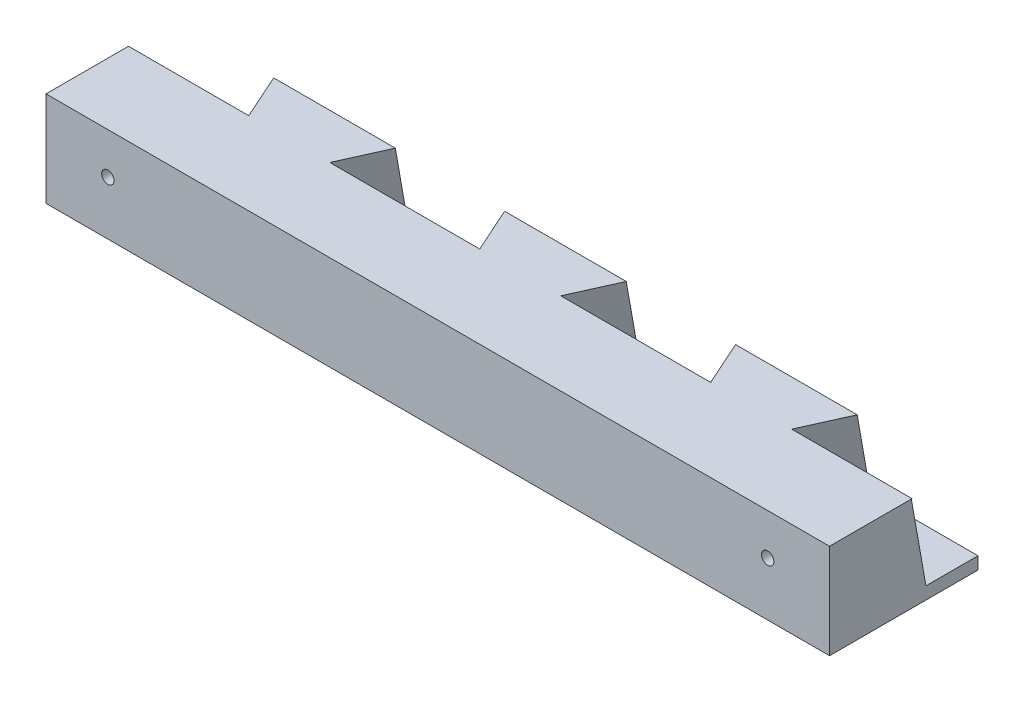
ISO-10303-21;
HEADER;
FILE_DESCRIPTION(('STEP AP214'),'2;1');
FILE_NAME('part.step','',(''),(''),'','','');
FILE_SCHEMA(('AUTOMOTIVE_DESIGN { 1 0 10303 214 1 1 1 1 }'));
ENDSEC;
DATA;
#1=APPLICATION_CONTEXT('core data for automotive mechanical design processes');
#2=APPLICATION_PROTOCOL_DEFINITION('international standard','automotive_design',2000,#1);
#3=PRODUCT_CONTEXT('',#1,'mechanical');
#4=PRODUCT('Part','Part','',(#3));
#5=PRODUCT_RELATED_PRODUCT_CATEGORY('part','',(#4));
#6=PRODUCT_DEFINITION_FORMATION('','',#4);
#7=PRODUCT_DEFINITION_CONTEXT('part definition',#1,'design');
#8=PRODUCT_DEFINITION('design','',#6,#7);
#9=PRODUCT_DEFINITION_SHAPE('','',#8);
#10=(LENGTH_UNIT() NAMED_UNIT(*) SI_UNIT(.MILLI.,.METRE.));
#11=(NAMED_UNIT(*) PLANE_ANGLE_UNIT() SI_UNIT($,.RADIAN.));
#12=(NAMED_UNIT(*) SI_UNIT($,.STERADIAN.) SOLID_ANGLE_UNIT());
#13=UNCERTAINTY_MEASURE_WITH_UNIT(LENGTH_MEASURE(1.E-05),#10,'distance_accuracy_value','');
#14=(GEOMETRIC_REPRESENTATION_CONTEXT(3) GLOBAL_UNCERTAINTY_ASSIGNED_CONTEXT((#13)) GLOBAL_UNIT_ASSIGNED_CONTEXT((#10,
#11,#12)) REPRESENTATION_CONTEXT('',''));
#15=CARTESIAN_POINT('',(0.,0.,0.));
#16=DIRECTION('',(0.,0.,1.));
#17=DIRECTION('',(1.,0.,0.));
#18=AXIS2_PLACEMENT_3D('',#15,#16,#17);
#19=CARTESIAN_POINT('',(0.,10.,0.));
#20=DIRECTION('',(0.,1.,0.));
#21=DIRECTION('',(0.,0.,1.));
#22=AXIS2_PLACEMENT_3D('',#19,#20,#21);
#23=PLANE('',#22);
#24=DIRECTION('',(1.,0.,0.));
#25=VECTOR('',#24,1.);
#26=CARTESIAN_POINT('',(0.,10.,0.));
#27=LINE('',#26,#25);
#28=CARTESIAN_POINT('',(32.9120559660088,10.,0.));
#29=VERTEX_POINT('',#28);
#30=CARTESIAN_POINT('',(47.5,10.,0.));
#31=VERTEX_POINT('',#30);
#32=EDGE_CURVE('E342',#29,#31,#27,.T.);
#33=ORIENTED_EDGE('',*,*,#32,.F.);
#34=DIRECTION('',(-0.410091119671907,0.,0.912044556787793));
#35=VECTOR('',#34,1.);
#36=CARTESIAN_POINT('',(27.3770799575527,10.,12.3098123765815));
#37=LINE('',#36,#35);
#38=CARTESIAN_POINT('',(35.3755299052489,10.,-5.47877749430423));
#39=VERTEX_POINT('',#38);
#40=EDGE_CURVE('E367',#39,#29,#37,.T.);
#41=ORIENTED_EDGE('',*,*,#40,.F.);
#42=DIRECTION('',(1.,0.,0.));
#43=VECTOR('',#42,1.);
#44=CARTESIAN_POINT('',(0.,10.,-5.47877749430424));
#45=LINE('',#44,#43);
#46=CARTESIAN_POINT('',(20.6244700947511,10.,-5.47877749430423));
#47=VERTEX_POINT('',#46);
#48=EDGE_CURVE('E365',#47,#39,#45,.T.);
#49=ORIENTED_EDGE('',*,*,#48,.F.);
#50=DIRECTION('',(-0.410091119671905,0.,-0.912044556787794));
#51=VECTOR('',#50,1.);
#52=CARTESIAN_POINT('',(19.2051353621568,10.,-8.63538453850985));
#53=LINE('',#52,#51);
#54=CARTESIAN_POINT('',(23.0879440339912,10.,0.));
#55=VERTEX_POINT('',#54);
#56=EDGE_CURVE('E363',#55,#47,#53,.T.);
#57=ORIENTED_EDGE('',*,*,#56,.F.);
#58=DIRECTION('',(1.,0.,0.));
#59=VECTOR('',#58,1.);
#60=CARTESIAN_POINT('',(0.,10.,0.));
#61=LINE('',#60,#59);
#62=CARTESIAN_POINT('',(4.91205596600882,10.,0.));
#63=VERTEX_POINT('',#62);
#64=EDGE_CURVE('E345',#63,#55,#61,.T.);
#65=ORIENTED_EDGE('',*,*,#64,.F.);
#66=DIRECTION('',(-0.410091119671905,0.,0.912044556787794));
#67=VECTOR('',#66,1.);
#68=CARTESIAN_POINT('',(4.08597229769799,10.,1.83721391903578));
#69=LINE('',#68,#67);
#70=CARTESIAN_POINT('',(7.37552990524885,10.,-5.47877749430422));
#71=VERTEX_POINT('',#70);
#72=EDGE_CURVE('E360',#71,#63,#69,.T.);
#73=ORIENTED_EDGE('',*,*,#72,.F.);
#74=DIRECTION('',(1.,0.,0.));
#75=VECTOR('',#74,1.);
#76=CARTESIAN_POINT('',(0.,10.,-5.47877749430422));
#77=LINE('',#76,#75);
#78=CARTESIAN_POINT('',(-7.37552990524885,10.,-5.47877749430422));
#79=VERTEX_POINT('',#78);
#80=EDGE_CURVE('E358',#79,#71,#77,.T.);
#81=ORIENTED_EDGE('',*,*,#80,.F.);
#82=DIRECTION('',(-0.410091119671904,0.,-0.912044556787794));
#83=VECTOR('',#82,1.);
#84=CARTESIAN_POINT('',(-4.085972297698,10.,1.83721391903578));
#85=LINE('',#84,#83);
#86=CARTESIAN_POINT('',(-4.91205596600882,10.,0.));
#87=VERTEX_POINT('',#86);
#88=EDGE_CURVE('E356',#87,#79,#85,.T.);
#89=ORIENTED_EDGE('',*,*,#88,.F.);
#90=DIRECTION('',(1.,0.,0.));
#91=VECTOR('',#90,1.);
#92=CARTESIAN_POINT('',(0.,10.,0.));
#93=LINE('',#92,#91);
#94=CARTESIAN_POINT('',(-23.0879440339912,10.,0.));
#95=VERTEX_POINT('',#94);
#96=EDGE_CURVE('E347',#95,#87,#93,.T.);
#97=ORIENTED_EDGE('',*,*,#96,.F.);
#98=DIRECTION('',(-0.410091119671905,0.,0.912044556787794));
#99=VECTOR('',#98,1.);
#100=CARTESIAN_POINT('',(-19.2051353621568,10.,-8.63538453850985));
#101=LINE('',#100,#99);
#102=CARTESIAN_POINT('',(-20.6244700947511,10.,-5.47877749430423));
#103=VERTEX_POINT('',#102);
#104=EDGE_CURVE('E353',#103,#95,#101,.T.);
#105=ORIENTED_EDGE('',*,*,#104,.F.);
#106=DIRECTION('',(1.,0.,0.));
#107=VECTOR('',#106,1.);
#108=CARTESIAN_POINT('',(0.,10.,-5.47877749430422));
#109=LINE('',#108,#107);
#110=CARTESIAN_POINT('',(-35.3755299052488,10.,-5.47877749430423));
#111=VERTEX_POINT('',#110);
#112=EDGE_CURVE('E351',#111,#103,#109,.T.);
#113=ORIENTED_EDGE('',*,*,#112,.F.);
#114=DIRECTION('',(-0.410091119671904,0.,-0.912044556787794));
#115=VECTOR('',#114,1.);
#116=CARTESIAN_POINT('',(-27.3770799575528,10.,12.3098123765814));
#117=LINE('',#116,#115);
#118=CARTESIAN_POINT('',(-32.9120559660088,10.,0.));
#119=VERTEX_POINT('',#118);
#120=EDGE_CURVE('E344',#119,#111,#117,.T.);
#121=ORIENTED_EDGE('',*,*,#120,.F.);
#122=DIRECTION('',(1.,0.,0.));
#123=VECTOR('',#122,1.);
#124=CARTESIAN_POINT('',(0.,10.,0.));
#125=LINE('',#124,#123);
#126=CARTESIAN_POINT('',(-47.5,10.,0.));
#127=VERTEX_POINT('',#126);
#128=EDGE_CURVE('E341',#127,#119,#125,.T.);
#129=ORIENTED_EDGE('',*,*,#128,.F.);
#130=DIRECTION('',(0.,0.,1.));
#131=VECTOR('',#130,1.);
#132=CARTESIAN_POINT('',(-47.5,10.,-10.));
#133=LINE('',#132,#131);
#134=CARTESIAN_POINT('',(-47.5,10.,10.));
#135=VERTEX_POINT('',#134);
#136=EDGE_CURVE('E334',#127,#135,#133,.T.);
#137=ORIENTED_EDGE('',*,*,#136,.T.);
#138=DIRECTION('',(1.,0.,0.));
#139=VECTOR('',#138,1.);
#140=CARTESIAN_POINT('',(-47.5,10.,10.));
#141=LINE('',#140,#139);
#142=CARTESIAN_POINT('',(47.5,10.,10.));
#143=VERTEX_POINT('',#142);
#144=EDGE_CURVE('E66',#135,#143,#141,.T.);
#145=ORIENTED_EDGE('',*,*,#144,.T.);
#146=DIRECTION('',(0.,0.,-1.));
#147=VECTOR('',#146,1.);
#148=CARTESIAN_POINT('',(47.5,10.,-10.));
#149=LINE('',#148,#147);
#150=EDGE_CURVE('E332',#143,#31,#149,.T.);
#151=ORIENTED_EDGE('',*,*,#150,.T.);
#152=EDGE_LOOP('',(#33,#41,#49,#57,#65,#73,#81,#89,#97,#105,#113,#121,#129,#137,#145,#151));
#153=FACE_BOUND('',#152,.T.);
#154=ADVANCED_FACE('F43',(#153),#23,.T.);
#155=CARTESIAN_POINT('',(-47.5,10.,10.));
#156=DIRECTION('',(0.,0.,-1.));
#157=DIRECTION('',(-1.,0.,0.));
#158=AXIS2_PLACEMENT_3D('',#155,#156,#157);
#159=PLANE('',#158);
#160=CARTESIAN_POINT('',(-40.,5.,10.));
#161=DIRECTION('',(0.,0.,1.));
#162=DIRECTION('',(1.,0.,0.));
#163=AXIS2_PLACEMENT_3D('',#160,#161,#162);
#164=CIRCLE('',#163,0.749999999999999);
#165=CARTESIAN_POINT('',(-39.25,5.,10.));
#166=VERTEX_POINT('',#165);
#167=EDGE_CURVE('E232',#166,#166,#164,.T.);
#168=ORIENTED_EDGE('',*,*,#167,.F.);
#169=EDGE_LOOP('',(#168));
#170=FACE_BOUND('',#169,.T.);
#171=CARTESIAN_POINT('',(40.,5.,10.));
#172=DIRECTION('',(0.,0.,1.));
#173=DIRECTION('',(-1.,0.,0.));
#174=AXIS2_PLACEMENT_3D('',#171,#172,#173);
#175=CIRCLE('',#174,0.749999999999999);
#176=CARTESIAN_POINT('',(39.25,5.,10.));
#177=VERTEX_POINT('',#176);
#178=EDGE_CURVE('E224',#177,#177,#175,.T.);
#179=ORIENTED_EDGE('',*,*,#178,.F.);
#180=EDGE_LOOP('',(#179));
#181=FACE_BOUND('',#180,.T.);
#182=DIRECTION('',(0.,-1.,0.));
#183=VECTOR('',#182,1.);
#184=CARTESIAN_POINT('',(-47.5,10.,10.));
#185=LINE('',#184,#183);
#186=CARTESIAN_POINT('',(-47.5,-1.5,10.));
#187=VERTEX_POINT('',#186);
#188=EDGE_CURVE('E339',#135,#187,#185,.T.);
#189=ORIENTED_EDGE('',*,*,#188,.T.);
#190=DIRECTION('',(-1.,0.,0.));
#191=VECTOR('',#190,1.);
#192=CARTESIAN_POINT('',(-47.5,-1.5,10.));
#193=LINE('',#192,#191);
#194=CARTESIAN_POINT('',(47.5,-1.5,10.));
#195=VERTEX_POINT('',#194);
#196=EDGE_CURVE('E211',#195,#187,#193,.T.);
#197=ORIENTED_EDGE('',*,*,#196,.F.);
#198=DIRECTION('',(0.,-1.,0.));
#199=VECTOR('',#198,1.);
#200=CARTESIAN_POINT('',(47.5,10.,10.));
#201=LINE('',#200,#199);
#202=EDGE_CURVE('E337',#143,#195,#201,.T.);
#203=ORIENTED_EDGE('',*,*,#202,.F.);
#204=ORIENTED_EDGE('',*,*,#144,.F.);
#205=EDGE_LOOP('',(#189,#197,#203,#204));
#206=FACE_BOUND('',#205,.T.);
#207=ADVANCED_FACE('F452',(#170,#181,#206),#159,.F.);
#208=CARTESIAN_POINT('',(47.5,10.,-10.));
#209=DIRECTION('',(-1.,0.,0.));
#210=DIRECTION('',(0.,0.,1.));
#211=AXIS2_PLACEMENT_3D('',#208,#209,#210);
#212=PLANE('',#211);
#213=ORIENTED_EDGE('',*,*,#202,.T.);
#214=DIRECTION('',(0.,0.,1.));
#215=VECTOR('',#214,1.);
#216=CARTESIAN_POINT('',(47.5,-1.5,10.));
#217=LINE('',#216,#215);
#218=CARTESIAN_POINT('',(47.5,-1.5,-8.));
#219=VERTEX_POINT('',#218);
#220=EDGE_CURVE('E204',#219,#195,#217,.T.);
#221=ORIENTED_EDGE('',*,*,#220,.F.);
#222=DIRECTION('',(0.,1.,0.));
#223=VECTOR('',#222,1.);
#224=CARTESIAN_POINT('',(47.5,-1.5,-8.));
#225=LINE('',#224,#223);
#226=CARTESIAN_POINT('',(47.5,0.,-8.));
#227=VERTEX_POINT('',#226);
#228=EDGE_CURVE('E200',#219,#227,#225,.T.);
#229=ORIENTED_EDGE('',*,*,#228,.T.);
#230=DIRECTION('',(0.,0.,1.));
#231=VECTOR('',#230,1.);
#232=CARTESIAN_POINT('',(47.5,0.,10.));
#233=LINE('',#232,#231);
#234=CARTESIAN_POINT('',(47.5,0.,-1.68203567813378));
#235=VERTEX_POINT('',#234);
#236=EDGE_CURVE('E214',#227,#235,#233,.T.);
#237=ORIENTED_EDGE('',*,*,#236,.T.);
#238=DIRECTION('',(0.,0.984807753012208,0.17364817766693));
#239=VECTOR('',#238,1.);
#240=CARTESIAN_POINT('',(47.5,-0.964709840352407,-1.85214005154287));
#241=LINE('',#240,#239);
#242=CARTESIAN_POINT('',(47.5,9.98610814578665,0.0787846202409846));
#243=VERTEX_POINT('',#242);
#244=EDGE_CURVE('E271',#235,#243,#241,.T.);
#245=ORIENTED_EDGE('',*,*,#244,.T.);
#246=DIRECTION('',(0.,0.17364817766693,-0.984807753012208));
#247=VECTOR('',#246,1.);
#248=CARTESIAN_POINT('',(47.5,11.865531846847,-10.5799568469409));
#249=LINE('',#248,#247);
#250=EDGE_CURVE('E267',#243,#31,#249,.T.);
#251=ORIENTED_EDGE('',*,*,#250,.T.);
#252=ORIENTED_EDGE('',*,*,#150,.F.);
#253=EDGE_LOOP('',(#213,#221,#229,#237,#245,#251,#252));
#254=FACE_BOUND('',#253,.T.);
#255=ADVANCED_FACE('F45',(#254),#212,.F.);
#256=CARTESIAN_POINT('',(-47.5,10.,-10.));
#257=DIRECTION('',(1.,0.,0.));
#258=DIRECTION('',(0.,0.,-1.));
#259=AXIS2_PLACEMENT_3D('',#256,#257,#258);
#260=PLANE('',#259);
#261=DIRECTION('',(0.,-0.17364817766693,0.984807753012208));
#262=VECTOR('',#261,1.);
#263=CARTESIAN_POINT('',(-47.5,9.98610814578664,0.0787846202409744));
#264=LINE('',#263,#262);
#265=CARTESIAN_POINT('',(-47.5,9.98610814578664,0.0787846202409744));
#266=VERTEX_POINT('',#265);
#267=EDGE_CURVE('E58',#127,#266,#264,.T.);
#268=ORIENTED_EDGE('',*,*,#267,.T.);
#269=DIRECTION('',(0.,0.984807753012208,0.17364817766693));
#270=VECTOR('',#269,1.);
#271=CARTESIAN_POINT('',(-47.5,-0.964709840352415,-1.85214005154288));
#272=LINE('',#271,#270);
#273=CARTESIAN_POINT('',(-47.5,0.,-1.68203567813379));
#274=VERTEX_POINT('',#273);
#275=EDGE_CURVE('E270',#274,#266,#272,.T.);
#276=ORIENTED_EDGE('',*,*,#275,.F.);
#277=DIRECTION('',(0.,0.,-1.));
#278=VECTOR('',#277,1.);
#279=CARTESIAN_POINT('',(-47.5,0.,10.));
#280=LINE('',#279,#278);
#281=CARTESIAN_POINT('',(-47.5,0.,-8.));
#282=VERTEX_POINT('',#281);
#283=EDGE_CURVE('E219',#274,#282,#280,.T.);
#284=ORIENTED_EDGE('',*,*,#283,.T.);
#285=DIRECTION('',(0.,1.,0.));
#286=VECTOR('',#285,1.);
#287=CARTESIAN_POINT('',(-47.5,-1.5,-8.));
#288=LINE('',#287,#286);
#289=CARTESIAN_POINT('',(-47.5,-1.5,-8.));
#290=VERTEX_POINT('',#289);
#291=EDGE_CURVE('E198',#290,#282,#288,.T.);
#292=ORIENTED_EDGE('',*,*,#291,.F.);
#293=DIRECTION('',(0.,0.,-1.));
#294=VECTOR('',#293,1.);
#295=CARTESIAN_POINT('',(-47.5,-1.5,10.));
#296=LINE('',#295,#294);
#297=EDGE_CURVE('E205',#187,#290,#296,.T.);
#298=ORIENTED_EDGE('',*,*,#297,.F.);
#299=ORIENTED_EDGE('',*,*,#188,.F.);
#300=ORIENTED_EDGE('',*,*,#136,.F.);
#301=EDGE_LOOP('',(#268,#276,#284,#292,#298,#299,#300));
#302=FACE_BOUND('',#301,.T.);
#303=ADVANCED_FACE('F216',(#302),#260,.F.);
#304=CARTESIAN_POINT('',(47.5,-0.964709840352407,-1.85214005154287));
#305=DIRECTION('',(0.,-0.17364817766693,0.984807753012208));
#306=DIRECTION('',(0.,-0.984807753012208,-0.17364817766693));
#307=AXIS2_PLACEMENT_3D('',#304,#305,#306);
#308=PLANE('',#307);
#309=DIRECTION('',(0.,0.984807753012208,0.17364817766693));
#310=VECTOR('',#309,1.);
#311=CARTESIAN_POINT('',(32.8755299052488,-0.964709840352407,-1.85214005154288));
#312=LINE('',#311,#310);
#313=CARTESIAN_POINT('',(32.8755299052488,0.,-1.68203567813379));
#314=VERTEX_POINT('',#313);
#315=CARTESIAN_POINT('',(32.8755299052488,9.98610814578665,0.078784620240977));
#316=VERTEX_POINT('',#315);
#317=EDGE_CURVE('E275',#314,#316,#312,.T.);
#318=ORIENTED_EDGE('',*,*,#317,.T.);
#319=DIRECTION('',(1.,0.,0.));
#320=VECTOR('',#319,1.);
#321=CARTESIAN_POINT('',(47.5,9.98610814578665,0.0787846202409846));
#322=LINE('',#321,#320);
#323=EDGE_CURVE('E265',#316,#243,#322,.T.);
#324=ORIENTED_EDGE('',*,*,#323,.T.);
#325=ORIENTED_EDGE('',*,*,#244,.F.);
#326=DIRECTION('',(1.,0.,0.));
#327=VECTOR('',#326,1.);
#328=CARTESIAN_POINT('',(0.,0.,-1.68203567813381));
#329=LINE('',#328,#327);
#330=EDGE_CURVE('E11',#314,#235,#329,.T.);
#331=ORIENTED_EDGE('',*,*,#330,.F.);
#332=EDGE_LOOP('',(#318,#324,#325,#331));
#333=FACE_BOUND('',#332,.T.);
#334=ADVANCED_FACE('F460',(#333),#308,.F.);
#335=CARTESIAN_POINT('',(23.1244700947512,-0.964709840352412,-1.85214005154286));
#336=DIRECTION('',(0.,-0.17364817766693,0.984807753012208));
#337=DIRECTION('',(0.,-0.984807753012208,-0.17364817766693));
#338=AXIS2_PLACEMENT_3D('',#335,#336,#337);
#339=PLANE('',#338);
#340=DIRECTION('',(0.,0.984807753012208,0.17364817766693));
#341=VECTOR('',#340,1.);
#342=CARTESIAN_POINT('',(4.87552990524886,-0.964709840352412,-1.85214005154286));
#343=LINE('',#342,#341);
#344=CARTESIAN_POINT('',(4.87552990524886,0.,-1.68203567813378));
#345=VERTEX_POINT('',#344);
#346=CARTESIAN_POINT('',(4.87552990524885,9.98610814578664,0.0787846202409878));
#347=VERTEX_POINT('',#346);
#348=EDGE_CURVE('E285',#345,#347,#343,.T.);
#349=ORIENTED_EDGE('',*,*,#348,.T.);
#350=DIRECTION('',(1.,0.,0.));
#351=VECTOR('',#350,1.);
#352=CARTESIAN_POINT('',(23.1244700947512,9.98610814578664,0.0787846202409963));
#353=LINE('',#352,#351);
#354=CARTESIAN_POINT('',(23.1244700947512,9.98610814578664,0.0787846202409963));
#355=VERTEX_POINT('',#354);
#356=EDGE_CURVE('E256',#347,#355,#353,.T.);
#357=ORIENTED_EDGE('',*,*,#356,.T.);
#358=DIRECTION('',(0.,0.984807753012208,0.17364817766693));
#359=VECTOR('',#358,1.);
#360=CARTESIAN_POINT('',(23.1244700947512,-0.964709840352412,-1.85214005154286));
#361=LINE('',#360,#359);
#362=CARTESIAN_POINT('',(23.1244700947512,0.,-1.68203567813377));
#363=VERTEX_POINT('',#362);
#364=EDGE_CURVE('E283',#363,#355,#361,.T.);
#365=ORIENTED_EDGE('',*,*,#364,.F.);
#366=DIRECTION('',(1.,0.,0.));
#367=VECTOR('',#366,1.);
#368=CARTESIAN_POINT('',(0.,0.,-1.68203567813378));
#369=LINE('',#368,#367);
#370=EDGE_CURVE('E51',#345,#363,#369,.T.);
#371=ORIENTED_EDGE('',*,*,#370,.F.);
#372=EDGE_LOOP('',(#349,#357,#365,#371));
#373=FACE_BOUND('',#372,.T.);
#374=ADVANCED_FACE('F381',(#373),#339,.F.);
#375=CARTESIAN_POINT('',(-4.87552990524886,-0.964709840352412,-1.85214005154287));
#376=DIRECTION('',(0.,-0.17364817766693,0.984807753012208));
#377=DIRECTION('',(0.,-0.984807753012208,-0.17364817766693));
#378=AXIS2_PLACEMENT_3D('',#375,#376,#377);
#379=PLANE('',#378);
#380=DIRECTION('',(0.,0.984807753012208,0.17364817766693));
#381=VECTOR('',#380,1.);
#382=CARTESIAN_POINT('',(-23.1244700947511,-0.964709840352414,-1.85214005154288));
#383=LINE('',#382,#381);
#384=CARTESIAN_POINT('',(-23.1244700947511,0.,-1.68203567813379));
#385=VERTEX_POINT('',#384);
#386=CARTESIAN_POINT('',(-23.1244700947511,9.98610814578664,0.0787846202409768));
#387=VERTEX_POINT('',#386);
#388=EDGE_CURVE('E295',#385,#387,#383,.T.);
#389=ORIENTED_EDGE('',*,*,#388,.T.);
#390=DIRECTION('',(1.,0.,0.));
#391=VECTOR('',#390,1.);
#392=CARTESIAN_POINT('',(-4.87552990524886,9.98610814578664,0.0787846202409852));
#393=LINE('',#392,#391);
#394=CARTESIAN_POINT('',(-4.87552990524886,9.98610814578664,0.0787846202409852));
#395=VERTEX_POINT('',#394);
#396=EDGE_CURVE('E247',#387,#395,#393,.T.);
#397=ORIENTED_EDGE('',*,*,#396,.T.);
#398=DIRECTION('',(0.,0.984807753012208,0.17364817766693));
#399=VECTOR('',#398,1.);
#400=CARTESIAN_POINT('',(-4.87552990524886,-0.964709840352412,-1.85214005154287));
#401=LINE('',#400,#399);
#402=CARTESIAN_POINT('',(-4.87552990524886,0.,-1.68203567813378));
#403=VERTEX_POINT('',#402);
#404=EDGE_CURVE('E293',#403,#395,#401,.T.);
#405=ORIENTED_EDGE('',*,*,#404,.F.);
#406=DIRECTION('',(1.,0.,0.));
#407=VECTOR('',#406,1.);
#408=CARTESIAN_POINT('',(0.,0.,-1.68203567813378));
#409=LINE('',#408,#407);
#410=EDGE_CURVE('E373',#385,#403,#409,.T.);
#411=ORIENTED_EDGE('',*,*,#410,.F.);
#412=EDGE_LOOP('',(#389,#397,#405,#411));
#413=FACE_BOUND('',#412,.T.);
#414=ADVANCED_FACE('F634',(#413),#379,.F.);
#415=CARTESIAN_POINT('',(-32.8755299052488,-0.964709840352415,-1.85214005154287));
#416=DIRECTION('',(0.,-0.17364817766693,0.984807753012208));
#417=DIRECTION('',(0.,-0.984807753012208,-0.17364817766693));
#418=AXIS2_PLACEMENT_3D('',#415,#416,#417);
#419=PLANE('',#418);
#420=ORIENTED_EDGE('',*,*,#275,.T.);
#421=DIRECTION('',(1.,0.,0.));
#422=VECTOR('',#421,1.);
#423=CARTESIAN_POINT('',(-32.8755299052488,9.98610814578664,0.0787846202409813));
#424=LINE('',#423,#422);
#425=CARTESIAN_POINT('',(-32.8755299052488,9.98610814578664,0.0787846202409813));
#426=VERTEX_POINT('',#425);
#427=EDGE_CURVE('E238',#266,#426,#424,.T.);
#428=ORIENTED_EDGE('',*,*,#427,.T.);
#429=DIRECTION('',(0.,0.984807753012208,0.17364817766693));
#430=VECTOR('',#429,1.);
#431=CARTESIAN_POINT('',(-32.8755299052488,-0.964709840352415,-1.85214005154287));
#432=LINE('',#431,#430);
#433=CARTESIAN_POINT('',(-32.8755299052488,0.,-1.68203567813378));
#434=VERTEX_POINT('',#433);
#435=EDGE_CURVE('E303',#434,#426,#432,.T.);
#436=ORIENTED_EDGE('',*,*,#435,.F.);
#437=DIRECTION('',(1.,0.,0.));
#438=VECTOR('',#437,1.);
#439=CARTESIAN_POINT('',(0.,0.,-1.68203567813377));
#440=LINE('',#439,#438);
#441=EDGE_CURVE('E370',#274,#434,#440,.T.);
#442=ORIENTED_EDGE('',*,*,#441,.F.);
#443=EDGE_LOOP('',(#420,#428,#436,#442));
#444=FACE_BOUND('',#443,.T.);
#445=ADVANCED_FACE('F625',(#444),#419,.F.);
#446=CARTESIAN_POINT('',(32.8755299052488,-0.964709840352407,-1.85214005154288));
#447=DIRECTION('',(-0.909669438270568,0.0721218211227004,-0.409023172930892));
#448=DIRECTION('',(-0.410091119671907,0.,0.912044556787793));
#449=AXIS2_PLACEMENT_3D('',#446,#447,#448);
#450=PLANE('',#449);
#451=DIRECTION('',(0.,0.984807753012208,0.17364817766693));
#452=VECTOR('',#451,1.);
#453=CARTESIAN_POINT('',(35.3755299052489,-0.0138918542133618,-7.24449681009876));
#454=LINE('',#453,#452);
#455=CARTESIAN_POINT('',(35.3755299052489,0.,-7.24204730138888));
#456=VERTEX_POINT('',#455);
#457=EDGE_CURVE('E277',#456,#39,#454,.T.);
#458=ORIENTED_EDGE('',*,*,#457,.T.);
#459=ORIENTED_EDGE('',*,*,#40,.T.);
#460=DIRECTION('',(-0.415333014671973,-0.157962440234984,0.895849515487116));
#461=VECTOR('',#460,1.);
#462=CARTESIAN_POINT('',(32.8755299052488,9.98610814578665,0.078784620240977));
#463=LINE('',#462,#461);
#464=EDGE_CURVE('E262',#29,#316,#463,.T.);
#465=ORIENTED_EDGE('',*,*,#464,.T.);
#466=ORIENTED_EDGE('',*,*,#317,.F.);
#467=DIRECTION('',(-0.410091119671907,0.,0.912044556787793));
#468=VECTOR('',#467,1.);
#469=CARTESIAN_POINT('',(26.7175793624845,0.,12.0132749591461));
#470=LINE('',#469,#468);
#471=EDGE_CURVE('E329',#456,#314,#470,.T.);
#472=ORIENTED_EDGE('',*,*,#471,.F.);
#473=EDGE_LOOP('',(#458,#459,#465,#466,#472));
#474=FACE_BOUND('',#473,.T.);
#475=ADVANCED_FACE('F401',(#474),#450,.F.);
#476=CARTESIAN_POINT('',(35.3755299052489,-0.0138918542133618,-7.24449681009876));
#477=DIRECTION('',(0.,-0.17364817766693,0.984807753012208));
#478=DIRECTION('',(0.,-0.984807753012208,-0.17364817766693));
#479=AXIS2_PLACEMENT_3D('',#476,#477,#478);
#480=PLANE('',#479);
#481=DIRECTION('',(0.,0.984807753012208,0.17364817766693));
#482=VECTOR('',#481,1.);
#483=CARTESIAN_POINT('',(20.6244700947511,-0.0138918542133635,-7.24449681009877));
#484=LINE('',#483,#482);
#485=CARTESIAN_POINT('',(20.6244700947511,0.,-7.24204730138888));
#486=VERTEX_POINT('',#485);
#487=EDGE_CURVE('E280',#486,#47,#484,.T.);
#488=ORIENTED_EDGE('',*,*,#487,.T.);
#489=ORIENTED_EDGE('',*,*,#48,.T.);
#490=ORIENTED_EDGE('',*,*,#457,.F.);
#491=DIRECTION('',(1.,0.,0.));
#492=VECTOR('',#491,1.);
#493=CARTESIAN_POINT('',(0.,0.,-7.24204730138889));
#494=LINE('',#493,#492);
#495=EDGE_CURVE('E326',#486,#456,#494,.T.);
#496=ORIENTED_EDGE('',*,*,#495,.F.);
#497=EDGE_LOOP('',(#488,#489,#490,#496));
#498=FACE_BOUND('',#497,.T.);
#499=ADVANCED_FACE('F398',(#498),#480,.F.);
#500=CARTESIAN_POINT('',(20.6244700947511,-0.0138918542133635,-7.24449681009877));
#501=DIRECTION('',(0.909669438270569,0.0721218211227002,-0.409023172930889));
#502=DIRECTION('',(-0.410091119671905,0.,-0.912044556787794));
#503=AXIS2_PLACEMENT_3D('',#500,#501,#502);
#504=PLANE('',#503);
#505=ORIENTED_EDGE('',*,*,#364,.T.);
#506=DIRECTION('',(-0.41533301467197,0.157962440234984,-0.895849515487117));
#507=VECTOR('',#506,1.);
#508=CARTESIAN_POINT('',(20.6244700947511,10.9369261319257,-5.31357213831492));
#509=LINE('',#508,#507);
#510=EDGE_CURVE('E259',#355,#55,#509,.T.);
#511=ORIENTED_EDGE('',*,*,#510,.T.);
#512=ORIENTED_EDGE('',*,*,#56,.T.);
#513=ORIENTED_EDGE('',*,*,#487,.F.);
#514=DIRECTION('',(-0.410091119671905,0.,-0.912044556787794));
#515=VECTOR('',#514,1.);
#516=CARTESIAN_POINT('',(19.8646359572251,0.,-8.93192195594521));
#517=LINE('',#516,#515);
#518=EDGE_CURVE('E323',#363,#486,#517,.T.);
#519=ORIENTED_EDGE('',*,*,#518,.F.);
#520=EDGE_LOOP('',(#505,#511,#512,#513,#519));
#521=FACE_BOUND('',#520,.T.);
#522=ADVANCED_FACE('F393',(#521),#504,.F.);
#523=CARTESIAN_POINT('',(4.87552990524886,-0.964709840352412,-1.85214005154286));
#524=DIRECTION('',(-0.909669438270569,0.0721218211227,-0.409023172930889));
#525=DIRECTION('',(-0.410091119671905,0.,0.912044556787794));
#526=AXIS2_PLACEMENT_3D('',#523,#524,#525);
#527=PLANE('',#526);
#528=DIRECTION('',(0.,0.984807753012208,0.17364817766693));
#529=VECTOR('',#528,1.);
#530=CARTESIAN_POINT('',(7.37552990524885,-0.013891854213367,-7.24449681009875));
#531=LINE('',#530,#529);
#532=CARTESIAN_POINT('',(7.37552990524885,0.,-7.24204730138887));
#533=VERTEX_POINT('',#532);
#534=EDGE_CURVE('E287',#533,#71,#531,.T.);
#535=ORIENTED_EDGE('',*,*,#534,.T.);
#536=ORIENTED_EDGE('',*,*,#72,.T.);
#537=DIRECTION('',(-0.41533301467197,-0.157962440234985,0.895849515487117));
#538=VECTOR('',#537,1.);
#539=CARTESIAN_POINT('',(4.87552990524885,9.98610814578664,0.0787846202409878));
#540=LINE('',#539,#538);
#541=EDGE_CURVE('E253',#63,#347,#540,.T.);
#542=ORIENTED_EDGE('',*,*,#541,.T.);
#543=ORIENTED_EDGE('',*,*,#348,.F.);
#544=DIRECTION('',(-0.410091119671905,0.,0.912044556787794));
#545=VECTOR('',#544,1.);
#546=CARTESIAN_POINT('',(3.42647170262973,0.,1.54067650160042));
#547=LINE('',#546,#545);
#548=EDGE_CURVE('E320',#533,#345,#547,.T.);
#549=ORIENTED_EDGE('',*,*,#548,.F.);
#550=EDGE_LOOP('',(#535,#536,#542,#543,#549));
#551=FACE_BOUND('',#550,.T.);
#552=ADVANCED_FACE('F383',(#551),#527,.F.);
#553=CARTESIAN_POINT('',(7.37552990524885,-0.013891854213367,-7.24449681009875));
#554=DIRECTION('',(0.,-0.17364817766693,0.984807753012208));
#555=DIRECTION('',(0.,-0.984807753012208,-0.17364817766693));
#556=AXIS2_PLACEMENT_3D('',#553,#554,#555);
#557=PLANE('',#556);
#558=DIRECTION('',(0.,0.984807753012208,0.17364817766693));
#559=VECTOR('',#558,1.);
#560=CARTESIAN_POINT('',(-7.37552990524885,-0.013891854213367,-7.24449681009876));
#561=LINE('',#560,#559);
#562=CARTESIAN_POINT('',(-7.37552990524885,0.,-7.24204730138887));
#563=VERTEX_POINT('',#562);
#564=EDGE_CURVE('E290',#563,#79,#561,.T.);
#565=ORIENTED_EDGE('',*,*,#564,.T.);
#566=ORIENTED_EDGE('',*,*,#80,.T.);
#567=ORIENTED_EDGE('',*,*,#534,.F.);
#568=DIRECTION('',(1.,0.,0.));
#569=VECTOR('',#568,1.);
#570=CARTESIAN_POINT('',(0.,0.,-7.24204730138887));
#571=LINE('',#570,#569);
#572=EDGE_CURVE('E317',#563,#533,#571,.T.);
#573=ORIENTED_EDGE('',*,*,#572,.F.);
#574=EDGE_LOOP('',(#565,#566,#567,#573));
#575=FACE_BOUND('',#574,.T.);
#576=ADVANCED_FACE('F582',(#575),#557,.F.);
#577=CARTESIAN_POINT('',(-7.37552990524885,-0.013891854213367,-7.24449681009876));
#578=DIRECTION('',(0.90966943827057,0.0721218211227,-0.409023172930889));
#579=DIRECTION('',(-0.410091119671904,0.,-0.912044556787794));
#580=AXIS2_PLACEMENT_3D('',#577,#578,#579);
#581=PLANE('',#580);
#582=ORIENTED_EDGE('',*,*,#404,.T.);
#583=DIRECTION('',(-0.415333014671969,0.157962440234985,-0.895849515487117));
#584=VECTOR('',#583,1.);
#585=CARTESIAN_POINT('',(-7.37552990524885,10.9369261319257,-5.31357213831491));
#586=LINE('',#585,#584);
#587=EDGE_CURVE('E250',#395,#87,#586,.T.);
#588=ORIENTED_EDGE('',*,*,#587,.T.);
#589=ORIENTED_EDGE('',*,*,#88,.T.);
#590=ORIENTED_EDGE('',*,*,#564,.F.);
#591=DIRECTION('',(-0.410091119671904,0.,-0.912044556787794));
#592=VECTOR('',#591,1.);
#593=CARTESIAN_POINT('',(-3.42647170262973,0.,1.54067650160042));
#594=LINE('',#593,#592);
#595=EDGE_CURVE('E314',#403,#563,#594,.T.);
#596=ORIENTED_EDGE('',*,*,#595,.F.);
#597=EDGE_LOOP('',(#582,#588,#589,#590,#596));
#598=FACE_BOUND('',#597,.T.);
#599=ADVANCED_FACE('F572',(#598),#581,.F.);
#600=CARTESIAN_POINT('',(-23.1244700947511,-0.964709840352414,-1.85214005154288));
#601=DIRECTION('',(-0.909669438270569,0.0721218211227,-0.40902317293089));
#602=DIRECTION('',(-0.410091119671905,0.,0.912044556787794));
#603=AXIS2_PLACEMENT_3D('',#600,#601,#602);
#604=PLANE('',#603);
#605=DIRECTION('',(0.,0.984807753012208,0.17364817766693));
#606=VECTOR('',#605,1.);
#607=CARTESIAN_POINT('',(-20.6244700947511,-0.0138918542133687,-7.24449681009876));
#608=LINE('',#607,#606);
#609=CARTESIAN_POINT('',(-20.6244700947511,0.,-7.24204730138888));
#610=VERTEX_POINT('',#609);
#611=EDGE_CURVE('E297',#610,#103,#608,.T.);
#612=ORIENTED_EDGE('',*,*,#611,.T.);
#613=ORIENTED_EDGE('',*,*,#104,.T.);
#614=DIRECTION('',(-0.41533301467197,-0.157962440234985,0.895849515487117));
#615=VECTOR('',#614,1.);
#616=CARTESIAN_POINT('',(-23.1244700947511,9.98610814578664,0.0787846202409768));
#617=LINE('',#616,#615);
#618=EDGE_CURVE('E244',#95,#387,#617,.T.);
#619=ORIENTED_EDGE('',*,*,#618,.T.);
#620=ORIENTED_EDGE('',*,*,#388,.F.);
#621=DIRECTION('',(-0.410091119671905,0.,0.912044556787794));
#622=VECTOR('',#621,1.);
#623=CARTESIAN_POINT('',(-19.8646359572251,0.,-8.93192195594522));
#624=LINE('',#623,#622);
#625=EDGE_CURVE('E311',#610,#385,#624,.T.);
#626=ORIENTED_EDGE('',*,*,#625,.F.);
#627=EDGE_LOOP('',(#612,#613,#619,#620,#626));
#628=FACE_BOUND('',#627,.T.);
#629=ADVANCED_FACE('F562',(#628),#604,.F.);
#630=CARTESIAN_POINT('',(-20.6244700947511,-0.0138918542133687,-7.24449681009876));
#631=DIRECTION('',(0.,-0.17364817766693,0.984807753012208));
#632=DIRECTION('',(0.,-0.984807753012208,-0.17364817766693));
#633=AXIS2_PLACEMENT_3D('',#630,#631,#632);
#634=PLANE('',#633);
#635=DIRECTION('',(0.,0.984807753012208,0.17364817766693));
#636=VECTOR('',#635,1.);
#637=CARTESIAN_POINT('',(-35.3755299052488,-0.0138918542133687,-7.24449681009877));
#638=LINE('',#637,#636);
#639=CARTESIAN_POINT('',(-35.3755299052488,0.,-7.24204730138888));
#640=VERTEX_POINT('',#639);
#641=EDGE_CURVE('E300',#640,#111,#638,.T.);
#642=ORIENTED_EDGE('',*,*,#641,.T.);
#643=ORIENTED_EDGE('',*,*,#112,.T.);
#644=ORIENTED_EDGE('',*,*,#611,.F.);
#645=DIRECTION('',(1.,0.,0.));
#646=VECTOR('',#645,1.);
#647=CARTESIAN_POINT('',(0.,0.,-7.24204730138887));
#648=LINE('',#647,#646);
#649=EDGE_CURVE('E308',#640,#610,#648,.T.);
#650=ORIENTED_EDGE('',*,*,#649,.F.);
#651=EDGE_LOOP('',(#642,#643,#644,#650));
#652=FACE_BOUND('',#651,.T.);
#653=ADVANCED_FACE('F551',(#652),#634,.F.);
#654=CARTESIAN_POINT('',(-35.3755299052488,-0.0138918542133687,-7.24449681009877));
#655=DIRECTION('',(0.90966943827057,0.0721218211227,-0.409023172930888));
#656=DIRECTION('',(-0.410091119671904,0.,-0.912044556787794));
#657=AXIS2_PLACEMENT_3D('',#654,#655,#656);
#658=PLANE('',#657);
#659=ORIENTED_EDGE('',*,*,#435,.T.);
#660=DIRECTION('',(-0.415333014671969,0.157962440234985,-0.895849515487117));
#661=VECTOR('',#660,1.);
#662=CARTESIAN_POINT('',(-35.3755299052488,10.9369261319257,-5.31357213831492));
#663=LINE('',#662,#661);
#664=EDGE_CURVE('E241',#426,#119,#663,.T.);
#665=ORIENTED_EDGE('',*,*,#664,.T.);
#666=ORIENTED_EDGE('',*,*,#120,.T.);
#667=ORIENTED_EDGE('',*,*,#641,.F.);
#668=DIRECTION('',(-0.410091119671904,0.,-0.912044556787794));
#669=VECTOR('',#668,1.);
#670=CARTESIAN_POINT('',(-26.7175793624846,0.,12.013274959146));
#671=LINE('',#670,#669);
#672=EDGE_CURVE('E274',#434,#640,#671,.T.);
#673=ORIENTED_EDGE('',*,*,#672,.F.);
#674=EDGE_LOOP('',(#659,#665,#666,#667,#673));
#675=FACE_BOUND('',#674,.T.);
#676=ADVANCED_FACE('F539',(#675),#658,.F.);
#677=CARTESIAN_POINT('',(0.,9.69846310392955,1.71010071662834));
#678=DIRECTION('',(0.,-0.984807753012208,-0.17364817766693));
#679=DIRECTION('',(0.,0.17364817766693,-0.984807753012208));
#680=AXIS2_PLACEMENT_3D('',#677,#678,#679);
#681=PLANE('',#680);
#682=ORIENTED_EDGE('',*,*,#250,.F.);
#683=ORIENTED_EDGE('',*,*,#323,.F.);
#684=ORIENTED_EDGE('',*,*,#464,.F.);
#685=ORIENTED_EDGE('',*,*,#32,.T.);
#686=EDGE_LOOP('',(#682,#683,#684,#685));
#687=FACE_BOUND('',#686,.T.);
#688=ADVANCED_FACE('F521',(#687),#681,.T.);
#689=ORIENTED_EDGE('',*,*,#510,.F.);
#690=ORIENTED_EDGE('',*,*,#356,.F.);
#691=ORIENTED_EDGE('',*,*,#541,.F.);
#692=ORIENTED_EDGE('',*,*,#64,.T.);
#693=EDGE_LOOP('',(#689,#690,#691,#692));
#694=FACE_BOUND('',#693,.T.);
#695=ADVANCED_FACE('F390',(#694),#681,.T.);
#696=ORIENTED_EDGE('',*,*,#587,.F.);
#697=ORIENTED_EDGE('',*,*,#396,.F.);
#698=ORIENTED_EDGE('',*,*,#618,.F.);
#699=ORIENTED_EDGE('',*,*,#96,.T.);
#700=EDGE_LOOP('',(#696,#697,#698,#699));
#701=FACE_BOUND('',#700,.T.);
#702=ADVANCED_FACE('F519',(#701),#681,.T.);
#703=ORIENTED_EDGE('',*,*,#664,.F.);
#704=ORIENTED_EDGE('',*,*,#427,.F.);
#705=ORIENTED_EDGE('',*,*,#267,.F.);
#706=ORIENTED_EDGE('',*,*,#128,.T.);
#707=EDGE_LOOP('',(#703,#704,#705,#706));
#708=FACE_BOUND('',#707,.T.);
#709=ADVANCED_FACE('F510',(#708),#681,.T.);
#710=CARTESIAN_POINT('',(40.,5.,5.));
#711=DIRECTION('',(0.,0.,1.));
#712=DIRECTION('',(1.,0.,0.));
#713=AXIS2_PLACEMENT_3D('',#710,#711,#712);
#714=CYLINDRICAL_SURFACE('',#713,0.749999999999999);
#715=CARTESIAN_POINT('',(40.,5.,5.));
#716=DIRECTION('',(0.,0.,1.));
#717=DIRECTION('',(-1.,0.,0.));
#718=AXIS2_PLACEMENT_3D('',#715,#716,#717);
#719=CIRCLE('',#718,0.749999999999999);
#720=CARTESIAN_POINT('',(39.25,5.,5.));
#721=VERTEX_POINT('',#720);
#722=EDGE_CURVE('E221',#721,#721,#719,.T.);
#723=ORIENTED_EDGE('',*,*,#722,.F.);
#724=EDGE_LOOP('',(#723));
#725=FACE_BOUND('',#724,.T.);
#726=ORIENTED_EDGE('',*,*,#178,.T.);
#727=EDGE_LOOP('',(#726));
#728=FACE_BOUND('',#727,.T.);
#729=ADVANCED_FACE('F501',(#725,#728),#714,.F.);
#730=CARTESIAN_POINT('',(40.,5.,5.));
#731=DIRECTION('',(0.,0.,-1.));
#732=DIRECTION('',(-1.,0.,0.));
#733=AXIS2_PLACEMENT_3D('',#730,#731,#732);
#734=PLANE('',#733);
#735=ORIENTED_EDGE('',*,*,#722,.T.);
#736=EDGE_LOOP('',(#735));
#737=FACE_BOUND('',#736,.T.);
#738=ADVANCED_FACE('F492',(#737),#734,.F.);
#739=CARTESIAN_POINT('',(-40.,5.,5.));
#740=DIRECTION('',(0.,0.,1.));
#741=DIRECTION('',(1.,0.,0.));
#742=AXIS2_PLACEMENT_3D('',#739,#740,#741);
#743=CYLINDRICAL_SURFACE('',#742,0.749999999999999);
#744=CARTESIAN_POINT('',(-40.,5.,5.));
#745=DIRECTION('',(0.,0.,1.));
#746=DIRECTION('',(1.,0.,0.));
#747=AXIS2_PLACEMENT_3D('',#744,#745,#746);
#748=CIRCLE('',#747,0.749999999999999);
#749=CARTESIAN_POINT('',(-39.25,5.,5.));
#750=VERTEX_POINT('',#749);
#751=EDGE_CURVE('E229',#750,#750,#748,.T.);
#752=ORIENTED_EDGE('',*,*,#751,.F.);
#753=EDGE_LOOP('',(#752));
#754=FACE_BOUND('',#753,.T.);
#755=ORIENTED_EDGE('',*,*,#167,.T.);
#756=EDGE_LOOP('',(#755));
#757=FACE_BOUND('',#756,.T.);
#758=ADVANCED_FACE('F483',(#754,#757),#743,.F.);
#759=CARTESIAN_POINT('',(-40.,5.,5.));
#760=DIRECTION('',(0.,0.,1.));
#761=DIRECTION('',(1.,0.,0.));
#762=AXIS2_PLACEMENT_3D('',#759,#760,#761);
#763=PLANE('',#762);
#764=ORIENTED_EDGE('',*,*,#751,.T.);
#765=EDGE_LOOP('',(#764));
#766=FACE_BOUND('',#765,.T.);
#767=ADVANCED_FACE('F480',(#766),#763,.T.);
#768=CARTESIAN_POINT('',(0.,0.,0.));
#769=DIRECTION('',(0.,-1.,0.));
#770=DIRECTION('',(0.,0.,-1.));
#771=AXIS2_PLACEMENT_3D('',#768,#769,#770);
#772=PLANE('',#771);
#773=ORIENTED_EDGE('',*,*,#471,.T.);
#774=ORIENTED_EDGE('',*,*,#330,.T.);
#775=ORIENTED_EDGE('',*,*,#236,.F.);
#776=DIRECTION('',(1.,0.,0.));
#777=VECTOR('',#776,1.);
#778=CARTESIAN_POINT('',(-47.5,0.,-8.));
#779=LINE('',#778,#777);
#780=EDGE_CURVE('E408',#282,#227,#779,.T.);
#781=ORIENTED_EDGE('',*,*,#780,.F.);
#782=ORIENTED_EDGE('',*,*,#283,.F.);
#783=ORIENTED_EDGE('',*,*,#441,.T.);
#784=ORIENTED_EDGE('',*,*,#672,.T.);
#785=ORIENTED_EDGE('',*,*,#649,.T.);
#786=ORIENTED_EDGE('',*,*,#625,.T.);
#787=ORIENTED_EDGE('',*,*,#410,.T.);
#788=ORIENTED_EDGE('',*,*,#595,.T.);
#789=ORIENTED_EDGE('',*,*,#572,.T.);
#790=ORIENTED_EDGE('',*,*,#548,.T.);
#791=ORIENTED_EDGE('',*,*,#370,.T.);
#792=ORIENTED_EDGE('',*,*,#518,.T.);
#793=ORIENTED_EDGE('',*,*,#495,.T.);
#794=EDGE_LOOP('',(#773,#774,#775,#781,#782,#783,#784,#785,#786,#787,#788,#789,#790,#791,#792,#793));
#795=FACE_BOUND('',#794,.T.);
#796=ADVANCED_FACE('F377',(#795),#772,.F.);
#797=CARTESIAN_POINT('',(-47.5,-1.5,-8.));
#798=DIRECTION('',(0.,0.,1.));
#799=DIRECTION('',(1.,0.,0.));
#800=AXIS2_PLACEMENT_3D('',#797,#798,#799);
#801=PLANE('',#800);
#802=ORIENTED_EDGE('',*,*,#780,.T.);
#803=ORIENTED_EDGE('',*,*,#228,.F.);
#804=DIRECTION('',(1.,0.,0.));
#805=VECTOR('',#804,1.);
#806=CARTESIAN_POINT('',(-47.5,-1.5,-8.));
#807=LINE('',#806,#805);
#808=EDGE_CURVE('E194',#290,#219,#807,.T.);
#809=ORIENTED_EDGE('',*,*,#808,.F.);
#810=ORIENTED_EDGE('',*,*,#291,.T.);
#811=EDGE_LOOP('',(#802,#803,#809,#810));
#812=FACE_BOUND('',#811,.T.);
#813=ADVANCED_FACE('F196',(#812),#801,.F.);
#814=CARTESIAN_POINT('',(0.,-1.5,0.));
#815=DIRECTION('',(0.,-1.,0.));
#816=DIRECTION('',(0.,0.,-1.));
#817=AXIS2_PLACEMENT_3D('',#814,#815,#816);
#818=PLANE('',#817);
#819=CARTESIAN_POINT('',(-40.,-1.5,5.));
#820=DIRECTION('',(0.,-1.,0.));
#821=DIRECTION('',(0.,0.,-1.));
#822=AXIS2_PLACEMENT_3D('',#819,#820,#821);
#823=CIRCLE('',#822,0.749999999999999);
#824=CARTESIAN_POINT('',(-40.,-1.5,4.25));
#825=VERTEX_POINT('',#824);
#826=EDGE_CURVE('E421',#825,#825,#823,.T.);
#827=ORIENTED_EDGE('',*,*,#826,.F.);
#828=EDGE_LOOP('',(#827));
#829=FACE_BOUND('',#828,.T.);
#830=CARTESIAN_POINT('',(40.,-1.5,5.));
#831=DIRECTION('',(0.,-1.,0.));
#832=DIRECTION('',(0.,0.,1.));
#833=AXIS2_PLACEMENT_3D('',#830,#831,#832);
#834=CIRCLE('',#833,0.749999999999999);
#835=CARTESIAN_POINT('',(40.,-1.5,5.74999999999999));
#836=VERTEX_POINT('',#835);
#837=EDGE_CURVE('E418',#836,#836,#834,.T.);
#838=ORIENTED_EDGE('',*,*,#837,.F.);
#839=EDGE_LOOP('',(#838));
#840=FACE_BOUND('',#839,.T.);
#841=ORIENTED_EDGE('',*,*,#297,.T.);
#842=ORIENTED_EDGE('',*,*,#808,.T.);
#843=ORIENTED_EDGE('',*,*,#220,.T.);
#844=ORIENTED_EDGE('',*,*,#196,.T.);
#845=EDGE_LOOP('',(#841,#842,#843,#844));
#846=FACE_BOUND('',#845,.T.);
#847=ADVANCED_FACE('F209',(#829,#840,#846),#818,.T.);
#848=CARTESIAN_POINT('',(40.,3.5,5.));
#849=DIRECTION('',(0.,-1.,0.));
#850=DIRECTION('',(0.,0.,-1.));
#851=AXIS2_PLACEMENT_3D('',#848,#849,#850);
#852=CYLINDRICAL_SURFACE('',#851,0.749999999999999);
#853=CARTESIAN_POINT('',(40.,3.5,5.));
#854=DIRECTION('',(0.,-1.,0.));
#855=DIRECTION('',(0.,0.,1.));
#856=AXIS2_PLACEMENT_3D('',#853,#854,#855);
#857=CIRCLE('',#856,0.749999999999999);
#858=CARTESIAN_POINT('',(40.,3.5,5.74999999999999));
#859=VERTEX_POINT('',#858);
#860=EDGE_CURVE('E415',#859,#859,#857,.T.);
#861=ORIENTED_EDGE('',*,*,#860,.F.);
#862=EDGE_LOOP('',(#861));
#863=FACE_BOUND('',#862,.T.);
#864=ORIENTED_EDGE('',*,*,#837,.T.);
#865=EDGE_LOOP('',(#864));
#866=FACE_BOUND('',#865,.T.);
#867=ADVANCED_FACE('F438',(#863,#866),#852,.F.);
#868=CARTESIAN_POINT('',(40.,3.5,5.));
#869=DIRECTION('',(0.,1.,0.));
#870=DIRECTION('',(0.,0.,1.));
#871=AXIS2_PLACEMENT_3D('',#868,#869,#870);
#872=PLANE('',#871);
#873=ORIENTED_EDGE('',*,*,#860,.T.);
#874=EDGE_LOOP('',(#873));
#875=FACE_BOUND('',#874,.T.);
#876=ADVANCED_FACE('F432',(#875),#872,.F.);
#877=CARTESIAN_POINT('',(-40.,3.5,5.));
#878=DIRECTION('',(0.,-1.,0.));
#879=DIRECTION('',(0.,0.,-1.));
#880=AXIS2_PLACEMENT_3D('',#877,#878,#879);
#881=CYLINDRICAL_SURFACE('',#880,0.749999999999999);
#882=CARTESIAN_POINT('',(-40.,3.5,5.));
#883=DIRECTION('',(0.,-1.,0.));
#884=DIRECTION('',(0.,0.,-1.));
#885=AXIS2_PLACEMENT_3D('',#882,#883,#884);
#886=CIRCLE('',#885,0.749999999999999);
#887=CARTESIAN_POINT('',(-40.,3.5,4.25));
#888=VERTEX_POINT('',#887);
#889=EDGE_CURVE('E412',#888,#888,#886,.T.);
#890=ORIENTED_EDGE('',*,*,#889,.F.);
#891=EDGE_LOOP('',(#890));
#892=FACE_BOUND('',#891,.T.);
#893=ORIENTED_EDGE('',*,*,#826,.T.);
#894=EDGE_LOOP('',(#893));
#895=FACE_BOUND('',#894,.T.);
#896=ADVANCED_FACE('F429',(#892,#895),#881,.F.);
#897=CARTESIAN_POINT('',(-40.,3.5,5.));
#898=DIRECTION('',(0.,-1.,0.));
#899=DIRECTION('',(0.,0.,-1.));
#900=AXIS2_PLACEMENT_3D('',#897,#898,#899);
#901=PLANE('',#900);
#902=ORIENTED_EDGE('',*,*,#889,.T.);
#903=EDGE_LOOP('',(#902));
#904=FACE_BOUND('',#903,.T.);
#905=ADVANCED_FACE('F427',(#904),#901,.T.);
#906=CLOSED_SHELL('',(#154,#207,#255,#303,#334,#374,#414,#445,#475,#499,#522,#552,#576,#599,
#629,#653,#676,#688,#695,#702,#709,#729,#738,#758,#767,#796,#813,#847,#867,#876,#896,#905));
#907=MANIFOLD_SOLID_BREP('B2',#906);
#908=ADVANCED_BREP_SHAPE_REPRESENTATION('',(#18,#907),#14);
#909=SHAPE_DEFINITION_REPRESENTATION(#9,#908);
ENDSEC;
END-ISO-10303-21;
